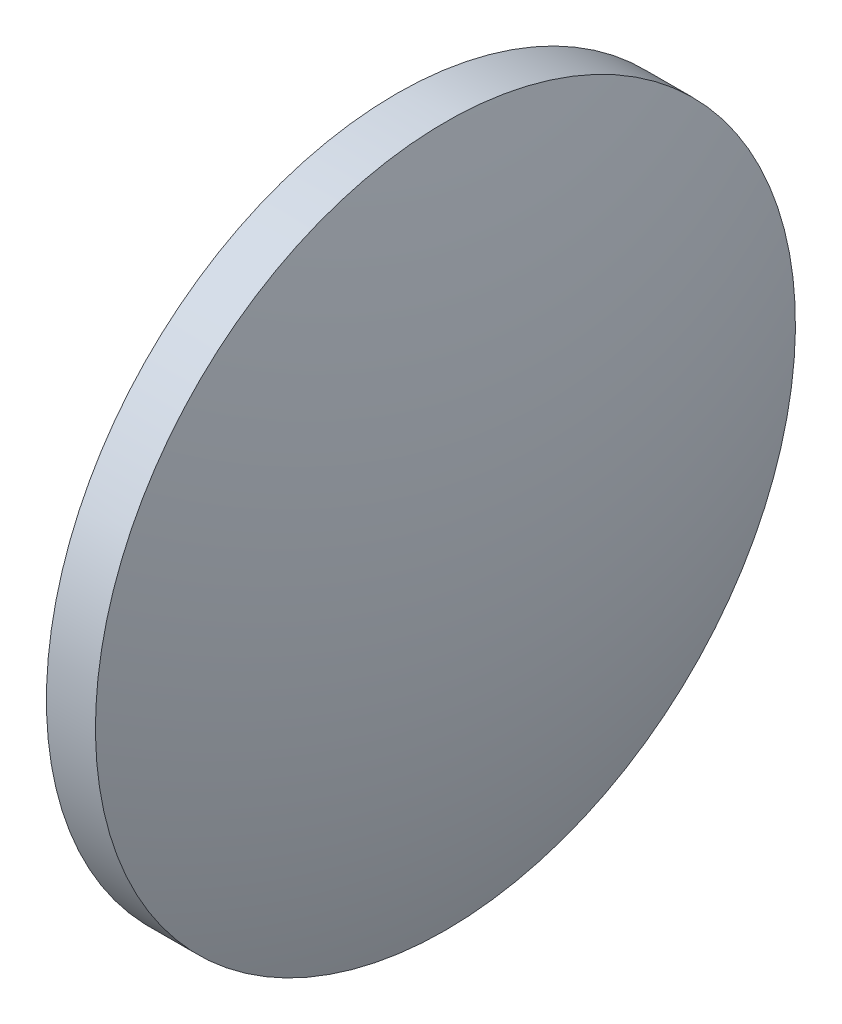
ISO-10303-21;
HEADER;
FILE_DESCRIPTION(('STEP AP214'),'2;1');
FILE_NAME('part.step','',(''),(''),'','','');
FILE_SCHEMA(('AUTOMOTIVE_DESIGN { 1 0 10303 214 1 1 1 1 }'));
ENDSEC;
DATA;
#1=APPLICATION_CONTEXT('core data for automotive mechanical design processes');
#2=APPLICATION_PROTOCOL_DEFINITION('international standard','automotive_design',2000,#1);
#3=PRODUCT_CONTEXT('',#1,'mechanical');
#4=PRODUCT('Part','Part','',(#3));
#5=PRODUCT_RELATED_PRODUCT_CATEGORY('part','',(#4));
#6=PRODUCT_DEFINITION_FORMATION('','',#4);
#7=PRODUCT_DEFINITION_CONTEXT('part definition',#1,'design');
#8=PRODUCT_DEFINITION('design','',#6,#7);
#9=PRODUCT_DEFINITION_SHAPE('','',#8);
#10=(LENGTH_UNIT() NAMED_UNIT(*) SI_UNIT(.MILLI.,.METRE.));
#11=(NAMED_UNIT(*) PLANE_ANGLE_UNIT() SI_UNIT($,.RADIAN.));
#12=(NAMED_UNIT(*) SI_UNIT($,.STERADIAN.) SOLID_ANGLE_UNIT());
#13=UNCERTAINTY_MEASURE_WITH_UNIT(LENGTH_MEASURE(1.E-05),#10,'distance_accuracy_value','');
#14=(GEOMETRIC_REPRESENTATION_CONTEXT(3) GLOBAL_UNCERTAINTY_ASSIGNED_CONTEXT((#13)) GLOBAL_UNIT_ASSIGNED_CONTEXT((#10,
#11,#12)) REPRESENTATION_CONTEXT('',''));
#15=CARTESIAN_POINT('',(0.,0.,0.));
#16=DIRECTION('',(0.,0.,1.));
#17=DIRECTION('',(1.,0.,0.));
#18=AXIS2_PLACEMENT_3D('',#15,#16,#17);
#19=CARTESIAN_POINT('',(62.4221628852423,24.5951782804403,0.));
#20=DIRECTION('',(-1.,0.,0.));
#21=DIRECTION('',(0.,1.,0.));
#22=AXIS2_PLACEMENT_3D('',#19,#20,#21);
#23=SPHERICAL_SURFACE('',#22,20.1824537057794);
#24=CARTESIAN_POINT('',(43.2897100973207,24.5951782804403,0.));
#25=DIRECTION('',(-1.,0.,0.));
#26=DIRECTION('',(0.,-1.,0.));
#27=AXIS2_PLACEMENT_3D('',#24,#25,#26);
#28=CIRCLE('',#27,6.42500489524182);
#29=CARTESIAN_POINT('',(43.2897100973207,18.1701733851985,0.));
#30=VERTEX_POINT('',#29);
#31=EDGE_CURVE('E41',#30,#30,#28,.T.);
#32=ORIENTED_EDGE('',*,*,#31,.T.);
#33=EDGE_LOOP('',(#32));
#34=FACE_BOUND('',#33,.T.);
#35=ADVANCED_FACE('F35',(#34),#23,.T.);
#36=CARTESIAN_POINT('',(25.057257309399,24.5951782804403,0.));
#37=DIRECTION('',(-1.,0.,0.));
#38=DIRECTION('',(0.,-1.,0.));
#39=AXIS2_PLACEMENT_3D('',#36,#37,#38);
#40=SPHERICAL_SURFACE('',#39,20.1824537057796);
#41=CARTESIAN_POINT('',(44.1897100973207,24.5951782804403,0.));
#42=DIRECTION('',(-1.,0.,0.));
#43=DIRECTION('',(0.,-1.,0.));
#44=AXIS2_PLACEMENT_3D('',#41,#42,#43);
#45=CIRCLE('',#44,6.42500489524182);
#46=CARTESIAN_POINT('',(44.1897100973207,18.1701733851985,0.));
#47=VERTEX_POINT('',#46);
#48=EDGE_CURVE('E10',#47,#47,#45,.T.);
#49=ORIENTED_EDGE('',*,*,#48,.F.);
#50=EDGE_LOOP('',(#49));
#51=FACE_BOUND('',#50,.T.);
#52=ADVANCED_FACE('F50',(#51),#40,.T.);
#53=CARTESIAN_POINT('',(41.0551494577938,24.5951782804403,0.));
#54=DIRECTION('',(-1.,0.,0.));
#55=DIRECTION('',(0.,-1.,0.));
#56=AXIS2_PLACEMENT_3D('',#53,#54,#55);
#57=CYLINDRICAL_SURFACE('',#56,6.42500489524182);
#58=ORIENTED_EDGE('',*,*,#48,.T.);
#59=EDGE_LOOP('',(#58));
#60=FACE_BOUND('',#59,.T.);
#61=ORIENTED_EDGE('',*,*,#31,.F.);
#62=EDGE_LOOP('',(#61));
#63=FACE_BOUND('',#62,.T.);
#64=ADVANCED_FACE('F48',(#60,#63),#57,.T.);
#65=CLOSED_SHELL('',(#35,#52,#64));
#66=MANIFOLD_SOLID_BREP('B2',#65);
#67=ADVANCED_BREP_SHAPE_REPRESENTATION('',(#18,#66),#14);
#68=SHAPE_DEFINITION_REPRESENTATION(#9,#67);
ENDSEC;
END-ISO-10303-21;
